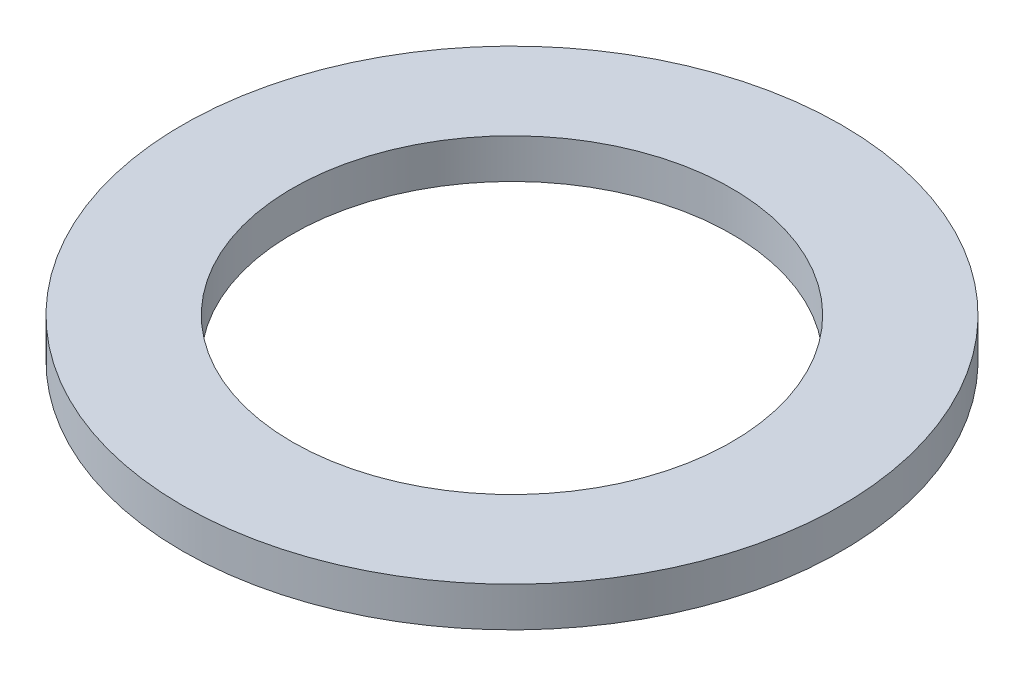
ISO-10303-21;
HEADER;
FILE_DESCRIPTION(('STEP AP214'),'2;1');
FILE_NAME('part.step','',(''),(''),'','','');
FILE_SCHEMA(('AUTOMOTIVE_DESIGN { 1 0 10303 214 1 1 1 1 }'));
ENDSEC;
DATA;
#1=APPLICATION_CONTEXT('core data for automotive mechanical design processes');
#2=APPLICATION_PROTOCOL_DEFINITION('international standard','automotive_design',2000,#1);
#3=PRODUCT_CONTEXT('',#1,'mechanical');
#4=PRODUCT('Part','Part','',(#3));
#5=PRODUCT_RELATED_PRODUCT_CATEGORY('part','',(#4));
#6=PRODUCT_DEFINITION_FORMATION('','',#4);
#7=PRODUCT_DEFINITION_CONTEXT('part definition',#1,'design');
#8=PRODUCT_DEFINITION('design','',#6,#7);
#9=PRODUCT_DEFINITION_SHAPE('','',#8);
#10=(LENGTH_UNIT() NAMED_UNIT(*) SI_UNIT(.MILLI.,.METRE.));
#11=(NAMED_UNIT(*) PLANE_ANGLE_UNIT() SI_UNIT($,.RADIAN.));
#12=(NAMED_UNIT(*) SI_UNIT($,.STERADIAN.) SOLID_ANGLE_UNIT());
#13=UNCERTAINTY_MEASURE_WITH_UNIT(LENGTH_MEASURE(1.E-05),#10,'distance_accuracy_value','');
#14=(GEOMETRIC_REPRESENTATION_CONTEXT(3) GLOBAL_UNCERTAINTY_ASSIGNED_CONTEXT((#13)) GLOBAL_UNIT_ASSIGNED_CONTEXT((#10,
#11,#12)) REPRESENTATION_CONTEXT('',''));
#15=CARTESIAN_POINT('',(0.,0.,0.));
#16=DIRECTION('',(0.,0.,1.));
#17=DIRECTION('',(1.,0.,0.));
#18=AXIS2_PLACEMENT_3D('',#15,#16,#17);
#19=CARTESIAN_POINT('',(0.,0.9,0.));
#20=DIRECTION('',(0.,1.,0.));
#21=DIRECTION('',(0.,0.,1.));
#22=AXIS2_PLACEMENT_3D('',#19,#20,#21);
#23=PLANE('',#22);
#24=CARTESIAN_POINT('',(0.,0.9,0.));
#25=DIRECTION('',(0.,1.,0.));
#26=DIRECTION('',(0.,0.,1.));
#27=AXIS2_PLACEMENT_3D('',#24,#25,#26);
#28=CIRCLE('',#27,7.5);
#29=CARTESIAN_POINT('',(0.,0.9,7.5));
#30=VERTEX_POINT('',#29);
#31=EDGE_CURVE('E10',#30,#30,#28,.T.);
#32=ORIENTED_EDGE('',*,*,#31,.T.);
#33=EDGE_LOOP('',(#32));
#34=FACE_BOUND('',#33,.T.);
#35=CARTESIAN_POINT('',(0.,0.9,0.));
#36=DIRECTION('',(0.,1.,0.));
#37=DIRECTION('',(0.,0.,1.));
#38=AXIS2_PLACEMENT_3D('',#35,#36,#37);
#39=CIRCLE('',#38,5.);
#40=CARTESIAN_POINT('',(0.,0.9,5.));
#41=VERTEX_POINT('',#40);
#42=EDGE_CURVE('E43',#41,#41,#39,.T.);
#43=ORIENTED_EDGE('',*,*,#42,.F.);
#44=EDGE_LOOP('',(#43));
#45=FACE_BOUND('',#44,.T.);
#46=ADVANCED_FACE('F32',(#34,#45),#23,.T.);
#47=CARTESIAN_POINT('',(0.,0.,0.));
#48=DIRECTION('',(0.,1.,0.));
#49=DIRECTION('',(0.,0.,1.));
#50=AXIS2_PLACEMENT_3D('',#47,#48,#49);
#51=PLANE('',#50);
#52=CARTESIAN_POINT('',(0.,0.,0.));
#53=DIRECTION('',(0.,1.,0.));
#54=DIRECTION('',(0.,0.,1.));
#55=AXIS2_PLACEMENT_3D('',#52,#53,#54);
#56=CIRCLE('',#55,7.5);
#57=CARTESIAN_POINT('',(0.,0.,7.5));
#58=VERTEX_POINT('',#57);
#59=EDGE_CURVE('E36',#58,#58,#56,.T.);
#60=ORIENTED_EDGE('',*,*,#59,.F.);
#61=EDGE_LOOP('',(#60));
#62=FACE_BOUND('',#61,.T.);
#63=CARTESIAN_POINT('',(0.,0.,0.));
#64=DIRECTION('',(0.,1.,0.));
#65=DIRECTION('',(0.,0.,1.));
#66=AXIS2_PLACEMENT_3D('',#63,#64,#65);
#67=CIRCLE('',#66,5.);
#68=CARTESIAN_POINT('',(0.,0.,5.));
#69=VERTEX_POINT('',#68);
#70=EDGE_CURVE('E45',#69,#69,#67,.T.);
#71=ORIENTED_EDGE('',*,*,#70,.T.);
#72=EDGE_LOOP('',(#71));
#73=FACE_BOUND('',#72,.T.);
#74=ADVANCED_FACE('F55',(#62,#73),#51,.F.);
#75=CARTESIAN_POINT('',(0.,0.9,0.));
#76=DIRECTION('',(0.,-1.,0.));
#77=DIRECTION('',(0.,0.,-1.));
#78=AXIS2_PLACEMENT_3D('',#75,#76,#77);
#79=CYLINDRICAL_SURFACE('',#78,7.5);
#80=ORIENTED_EDGE('',*,*,#31,.F.);
#81=EDGE_LOOP('',(#80));
#82=FACE_BOUND('',#81,.T.);
#83=ORIENTED_EDGE('',*,*,#59,.T.);
#84=EDGE_LOOP('',(#83));
#85=FACE_BOUND('',#84,.T.);
#86=ADVANCED_FACE('F34',(#82,#85),#79,.T.);
#87=CARTESIAN_POINT('',(0.,0.9,0.));
#88=DIRECTION('',(0.,-1.,0.));
#89=DIRECTION('',(0.,0.,-1.));
#90=AXIS2_PLACEMENT_3D('',#87,#88,#89);
#91=CYLINDRICAL_SURFACE('',#90,5.);
#92=ORIENTED_EDGE('',*,*,#42,.T.);
#93=EDGE_LOOP('',(#92));
#94=FACE_BOUND('',#93,.T.);
#95=ORIENTED_EDGE('',*,*,#70,.F.);
#96=EDGE_LOOP('',(#95));
#97=FACE_BOUND('',#96,.T.);
#98=ADVANCED_FACE('F51',(#94,#97),#91,.F.);
#99=CLOSED_SHELL('',(#46,#74,#86,#98));
#100=MANIFOLD_SOLID_BREP('B2',#99);
#101=ADVANCED_BREP_SHAPE_REPRESENTATION('',(#18,#100),#14);
#102=SHAPE_DEFINITION_REPRESENTATION(#9,#101);
ENDSEC;
END-ISO-10303-21;
